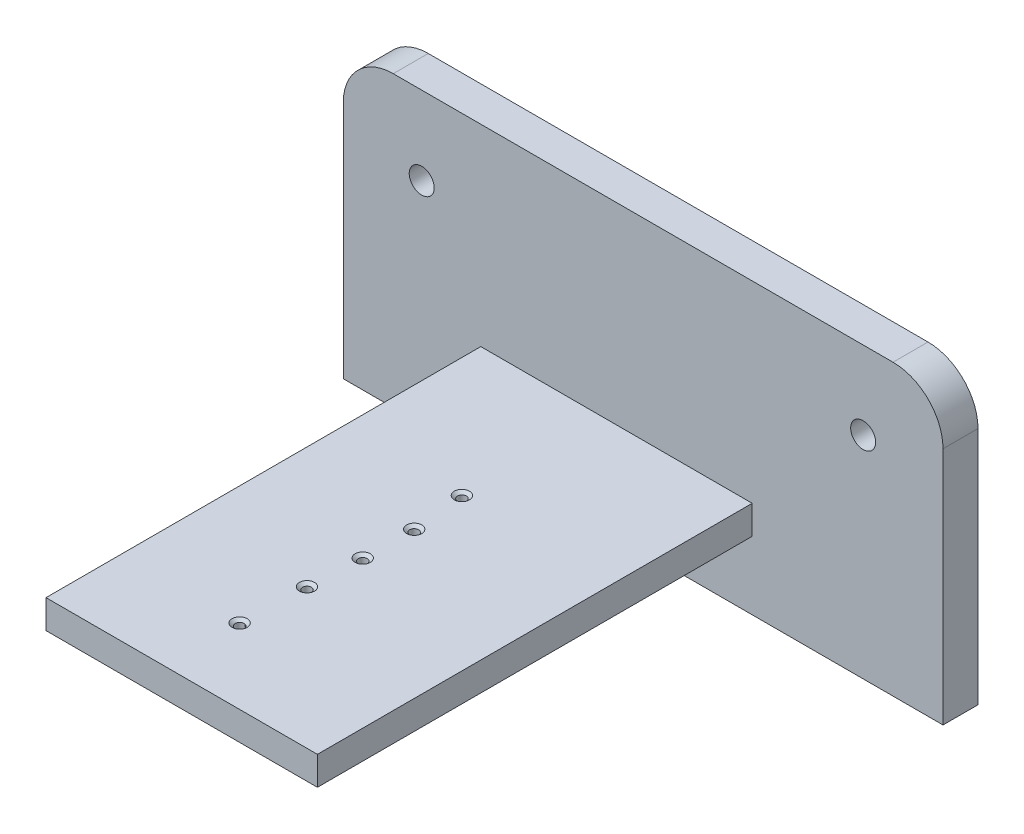
ISO-10303-21;
HEADER;
FILE_DESCRIPTION(('STEP AP214'),'2;1');
FILE_NAME('part.step','',(''),(''),'','','');
FILE_SCHEMA(('AUTOMOTIVE_DESIGN { 1 0 10303 214 1 1 1 1 }'));
ENDSEC;
DATA;
#1=APPLICATION_CONTEXT('core data for automotive mechanical design processes');
#2=APPLICATION_PROTOCOL_DEFINITION('international standard','automotive_design',2000,#1);
#3=PRODUCT_CONTEXT('',#1,'mechanical');
#4=PRODUCT('Part','Part','',(#3));
#5=PRODUCT_RELATED_PRODUCT_CATEGORY('part','',(#4));
#6=PRODUCT_DEFINITION_FORMATION('','',#4);
#7=PRODUCT_DEFINITION_CONTEXT('part definition',#1,'design');
#8=PRODUCT_DEFINITION('design','',#6,#7);
#9=PRODUCT_DEFINITION_SHAPE('','',#8);
#10=(LENGTH_UNIT() NAMED_UNIT(*) SI_UNIT(.MILLI.,.METRE.));
#11=(NAMED_UNIT(*) PLANE_ANGLE_UNIT() SI_UNIT($,.RADIAN.));
#12=(NAMED_UNIT(*) SI_UNIT($,.STERADIAN.) SOLID_ANGLE_UNIT());
#13=UNCERTAINTY_MEASURE_WITH_UNIT(LENGTH_MEASURE(1.E-05),#10,'distance_accuracy_value','');
#14=(GEOMETRIC_REPRESENTATION_CONTEXT(3) GLOBAL_UNCERTAINTY_ASSIGNED_CONTEXT((#13)) GLOBAL_UNIT_ASSIGNED_CONTEXT((#10,
#11,#12)) REPRESENTATION_CONTEXT('',''));
#15=CARTESIAN_POINT('',(0.,0.,0.));
#16=DIRECTION('',(0.,0.,1.));
#17=DIRECTION('',(1.,0.,0.));
#18=AXIS2_PLACEMENT_3D('',#15,#16,#17);
#19=CARTESIAN_POINT('',(0.,0.,7.));
#20=DIRECTION('',(0.,0.,-1.));
#21=DIRECTION('',(-1.,0.,0.));
#22=AXIS2_PLACEMENT_3D('',#19,#20,#21);
#23=PLANE('',#22);
#24=CARTESIAN_POINT('',(43.9129569594668,13.4683747706374,7.));
#25=DIRECTION('',(0.,0.,1.));
#26=DIRECTION('',(1.,0.,0.));
#27=AXIS2_PLACEMENT_3D('',#24,#25,#26);
#28=CIRCLE('',#27,2.5);
#29=CARTESIAN_POINT('',(46.4129569594668,13.4683747706374,7.));
#30=VERTEX_POINT('',#29);
#31=EDGE_CURVE('E146',#30,#30,#28,.T.);
#32=ORIENTED_EDGE('',*,*,#31,.F.);
#33=EDGE_LOOP('',(#32));
#34=FACE_BOUND('',#33,.T.);
#35=CARTESIAN_POINT('',(-44.4128113879004,13.3985765124555,7.));
#36=DIRECTION('',(0.,0.,1.));
#37=DIRECTION('',(1.,0.,0.));
#38=AXIS2_PLACEMENT_3D('',#35,#36,#37);
#39=CIRCLE('',#38,2.5);
#40=CARTESIAN_POINT('',(-41.9128113879004,13.3985765124555,7.));
#41=VERTEX_POINT('',#40);
#42=EDGE_CURVE('E155',#41,#41,#39,.T.);
#43=ORIENTED_EDGE('',*,*,#42,.F.);
#44=EDGE_LOOP('',(#43));
#45=FACE_BOUND('',#44,.T.);
#46=DIRECTION('',(0.,1.,0.));
#47=VECTOR('',#46,1.);
#48=CARTESIAN_POINT('',(59.8932384341637,-28.7722419928826,7.));
#49=LINE('',#48,#47);
#50=CARTESIAN_POINT('',(59.8932384341637,-28.7722419928826,7.));
#51=VERTEX_POINT('',#50);
#52=CARTESIAN_POINT('',(59.8932384341637,19.0925266903915,7.));
#53=VERTEX_POINT('',#52);
#54=EDGE_CURVE('E161',#51,#53,#49,.T.);
#55=ORIENTED_EDGE('',*,*,#54,.T.);
#56=CARTESIAN_POINT('',(49.8932384341637,19.0925266903915,7.));
#57=DIRECTION('',(0.,0.,-1.));
#58=DIRECTION('',(-1.,0.,0.));
#59=AXIS2_PLACEMENT_3D('',#56,#57,#58);
#60=CIRCLE('',#59,10.);
#61=CARTESIAN_POINT('',(49.8932384341637,29.0925266903915,7.));
#62=VERTEX_POINT('',#61);
#63=EDGE_CURVE('E45',#53,#62,#60,.F.);
#64=ORIENTED_EDGE('',*,*,#63,.T.);
#65=DIRECTION('',(-1.,0.,0.));
#66=VECTOR('',#65,1.);
#67=CARTESIAN_POINT('',(-60.1067615658363,29.0925266903915,7.));
#68=LINE('',#67,#66);
#69=CARTESIAN_POINT('',(-50.1067615658363,29.0925266903915,7.));
#70=VERTEX_POINT('',#69);
#71=EDGE_CURVE('E163',#62,#70,#68,.T.);
#72=ORIENTED_EDGE('',*,*,#71,.T.);
#73=CARTESIAN_POINT('',(-50.1067615658363,19.0925266903915,7.));
#74=DIRECTION('',(0.,0.,-1.));
#75=DIRECTION('',(-1.,0.,0.));
#76=AXIS2_PLACEMENT_3D('',#73,#74,#75);
#77=CIRCLE('',#76,10.);
#78=CARTESIAN_POINT('',(-60.1067615658363,19.0925266903915,7.));
#79=VERTEX_POINT('',#78);
#80=EDGE_CURVE('E53',#70,#79,#77,.F.);
#81=ORIENTED_EDGE('',*,*,#80,.T.);
#82=DIRECTION('',(0.,-1.,0.));
#83=VECTOR('',#82,1.);
#84=CARTESIAN_POINT('',(-60.1067615658363,-28.7722419928826,7.));
#85=LINE('',#84,#83);
#86=CARTESIAN_POINT('',(-60.1067615658363,-28.7722419928826,7.));
#87=VERTEX_POINT('',#86);
#88=EDGE_CURVE('E166',#79,#87,#85,.T.);
#89=ORIENTED_EDGE('',*,*,#88,.T.);
#90=DIRECTION('',(1.,0.,0.));
#91=VECTOR('',#90,1.);
#92=CARTESIAN_POINT('',(-60.1067615658363,-28.7722419928826,7.));
#93=LINE('',#92,#91);
#94=EDGE_CURVE('E168',#87,#51,#93,.T.);
#95=ORIENTED_EDGE('',*,*,#94,.T.);
#96=EDGE_LOOP('',(#55,#64,#72,#81,#89,#95));
#97=FACE_BOUND('',#96,.T.);
#98=DIRECTION('',(0.,1.,0.));
#99=VECTOR('',#98,1.);
#100=CARTESIAN_POINT('',(21.716112984393,-15.1625153646933,7.));
#101=LINE('',#100,#99);
#102=CARTESIAN_POINT('',(21.716112984393,-15.1625153646933,7.));
#103=VERTEX_POINT('',#102);
#104=CARTESIAN_POINT('',(21.716112984393,-9.44262442277477,7.));
#105=VERTEX_POINT('',#104);
#106=EDGE_CURVE('E142',#103,#105,#101,.T.);
#107=ORIENTED_EDGE('',*,*,#106,.F.);
#108=DIRECTION('',(1.,0.,0.));
#109=VECTOR('',#108,1.);
#110=CARTESIAN_POINT('',(-32.5899388944322,-15.1625153646933,7.));
#111=LINE('',#110,#109);
#112=CARTESIAN_POINT('',(-32.5899388944322,-15.1625153646933,7.));
#113=VERTEX_POINT('',#112);
#114=EDGE_CURVE('E139',#113,#103,#111,.T.);
#115=ORIENTED_EDGE('',*,*,#114,.F.);
#116=DIRECTION('',(0.,-1.,0.));
#117=VECTOR('',#116,1.);
#118=CARTESIAN_POINT('',(-32.5899388944322,-15.1625153646933,7.));
#119=LINE('',#118,#117);
#120=CARTESIAN_POINT('',(-32.5899388944322,-9.44262442277477,7.));
#121=VERTEX_POINT('',#120);
#122=EDGE_CURVE('E241',#121,#113,#119,.T.);
#123=ORIENTED_EDGE('',*,*,#122,.F.);
#124=DIRECTION('',(-1.,0.,0.));
#125=VECTOR('',#124,1.);
#126=CARTESIAN_POINT('',(-32.5899388944322,-9.44262442277477,7.));
#127=LINE('',#126,#125);
#128=EDGE_CURVE('E239',#105,#121,#127,.T.);
#129=ORIENTED_EDGE('',*,*,#128,.F.);
#130=EDGE_LOOP('',(#107,#115,#123,#129));
#131=FACE_BOUND('',#130,.T.);
#132=ADVANCED_FACE('F36',(#34,#45,#97,#131),#23,.F.);
#133=CARTESIAN_POINT('',(0.,0.,0.));
#134=DIRECTION('',(0.,0.,-1.));
#135=DIRECTION('',(-1.,0.,0.));
#136=AXIS2_PLACEMENT_3D('',#133,#134,#135);
#137=PLANE('',#136);
#138=CARTESIAN_POINT('',(-44.4128113879004,13.3985765124555,0.));
#139=DIRECTION('',(0.,0.,1.));
#140=DIRECTION('',(1.,0.,0.));
#141=AXIS2_PLACEMENT_3D('',#138,#139,#140);
#142=CIRCLE('',#141,2.5);
#143=CARTESIAN_POINT('',(-41.9128113879004,13.3985765124555,0.));
#144=VERTEX_POINT('',#143);
#145=EDGE_CURVE('E153',#144,#144,#142,.T.);
#146=ORIENTED_EDGE('',*,*,#145,.T.);
#147=EDGE_LOOP('',(#146));
#148=FACE_BOUND('',#147,.T.);
#149=DIRECTION('',(-1.,0.,0.));
#150=VECTOR('',#149,1.);
#151=CARTESIAN_POINT('',(-60.1067615658363,29.0925266903915,0.));
#152=LINE('',#151,#150);
#153=CARTESIAN_POINT('',(49.8932384341637,29.0925266903915,0.));
#154=VERTEX_POINT('',#153);
#155=CARTESIAN_POINT('',(-50.1067615658363,29.0925266903915,0.));
#156=VERTEX_POINT('',#155);
#157=EDGE_CURVE('E172',#154,#156,#152,.T.);
#158=ORIENTED_EDGE('',*,*,#157,.F.);
#159=CARTESIAN_POINT('',(49.8932384341637,19.0925266903915,0.));
#160=DIRECTION('',(0.,0.,-1.));
#161=DIRECTION('',(-1.,0.,0.));
#162=AXIS2_PLACEMENT_3D('',#159,#160,#161);
#163=CIRCLE('',#162,10.);
#164=CARTESIAN_POINT('',(59.8932384341637,19.0925266903915,0.));
#165=VERTEX_POINT('',#164);
#166=EDGE_CURVE('E190',#154,#165,#163,.T.);
#167=ORIENTED_EDGE('',*,*,#166,.T.);
#168=DIRECTION('',(0.,1.,0.));
#169=VECTOR('',#168,1.);
#170=CARTESIAN_POINT('',(59.8932384341637,-28.7722419928826,0.));
#171=LINE('',#170,#169);
#172=CARTESIAN_POINT('',(59.8932384341637,-28.7722419928826,0.));
#173=VERTEX_POINT('',#172);
#174=EDGE_CURVE('E158',#173,#165,#171,.T.);
#175=ORIENTED_EDGE('',*,*,#174,.F.);
#176=DIRECTION('',(1.,0.,0.));
#177=VECTOR('',#176,1.);
#178=CARTESIAN_POINT('',(-60.1067615658363,-28.7722419928826,0.));
#179=LINE('',#178,#177);
#180=CARTESIAN_POINT('',(-60.1067615658363,-28.7722419928826,0.));
#181=VERTEX_POINT('',#180);
#182=EDGE_CURVE('E164',#181,#173,#179,.T.);
#183=ORIENTED_EDGE('',*,*,#182,.F.);
#184=DIRECTION('',(0.,-1.,0.));
#185=VECTOR('',#184,1.);
#186=CARTESIAN_POINT('',(-60.1067615658363,-28.7722419928826,0.));
#187=LINE('',#186,#185);
#188=CARTESIAN_POINT('',(-60.1067615658363,19.0925266903915,0.));
#189=VERTEX_POINT('',#188);
#190=EDGE_CURVE('E175',#189,#181,#187,.T.);
#191=ORIENTED_EDGE('',*,*,#190,.F.);
#192=CARTESIAN_POINT('',(-50.1067615658363,19.0925266903915,0.));
#193=DIRECTION('',(0.,0.,-1.));
#194=DIRECTION('',(-1.,0.,0.));
#195=AXIS2_PLACEMENT_3D('',#192,#193,#194);
#196=CIRCLE('',#195,10.);
#197=EDGE_CURVE('E188',#189,#156,#196,.T.);
#198=ORIENTED_EDGE('',*,*,#197,.T.);
#199=EDGE_LOOP('',(#158,#167,#175,#183,#191,#198));
#200=FACE_BOUND('',#199,.T.);
#201=CARTESIAN_POINT('',(43.9129569594668,13.4683747706374,0.));
#202=DIRECTION('',(0.,0.,1.));
#203=DIRECTION('',(1.,0.,0.));
#204=AXIS2_PLACEMENT_3D('',#201,#202,#203);
#205=CIRCLE('',#204,2.5);
#206=CARTESIAN_POINT('',(46.4129569594668,13.4683747706374,0.));
#207=VERTEX_POINT('',#206);
#208=EDGE_CURVE('E143',#207,#207,#205,.T.);
#209=ORIENTED_EDGE('',*,*,#208,.T.);
#210=EDGE_LOOP('',(#209));
#211=FACE_BOUND('',#210,.T.);
#212=ADVANCED_FACE('F254',(#148,#200,#211),#137,.T.);
#213=CARTESIAN_POINT('',(59.8932384341637,-28.7722419928826,7.));
#214=DIRECTION('',(-1.,0.,0.));
#215=DIRECTION('',(0.,0.,1.));
#216=AXIS2_PLACEMENT_3D('',#213,#214,#215);
#217=PLANE('',#216);
#218=ORIENTED_EDGE('',*,*,#174,.T.);
#219=DIRECTION('',(0.,0.,-1.));
#220=VECTOR('',#219,1.);
#221=CARTESIAN_POINT('',(59.8932384341637,19.0925266903915,7.));
#222=LINE('',#221,#220);
#223=EDGE_CURVE('E61',#165,#53,#222,.F.);
#224=ORIENTED_EDGE('',*,*,#223,.T.);
#225=ORIENTED_EDGE('',*,*,#54,.F.);
#226=DIRECTION('',(0.,0.,-1.));
#227=VECTOR('',#226,1.);
#228=CARTESIAN_POINT('',(59.8932384341637,-28.7722419928826,7.));
#229=LINE('',#228,#227);
#230=EDGE_CURVE('E170',#51,#173,#229,.T.);
#231=ORIENTED_EDGE('',*,*,#230,.T.);
#232=EDGE_LOOP('',(#218,#224,#225,#231));
#233=FACE_BOUND('',#232,.T.);
#234=ADVANCED_FACE('F260',(#233),#217,.F.);
#235=CARTESIAN_POINT('',(-60.1067615658363,29.0925266903915,7.));
#236=DIRECTION('',(0.,-1.,0.));
#237=DIRECTION('',(0.,0.,-1.));
#238=AXIS2_PLACEMENT_3D('',#235,#236,#237);
#239=PLANE('',#238);
#240=ORIENTED_EDGE('',*,*,#71,.F.);
#241=DIRECTION('',(0.,0.,-1.));
#242=VECTOR('',#241,1.);
#243=CARTESIAN_POINT('',(49.8932384341637,29.0925266903915,7.));
#244=LINE('',#243,#242);
#245=EDGE_CURVE('E185',#62,#154,#244,.T.);
#246=ORIENTED_EDGE('',*,*,#245,.T.);
#247=ORIENTED_EDGE('',*,*,#157,.T.);
#248=DIRECTION('',(0.,0.,-1.));
#249=VECTOR('',#248,1.);
#250=CARTESIAN_POINT('',(-50.1067615658363,29.0925266903915,7.));
#251=LINE('',#250,#249);
#252=EDGE_CURVE('E183',#156,#70,#251,.F.);
#253=ORIENTED_EDGE('',*,*,#252,.T.);
#254=EDGE_LOOP('',(#240,#246,#247,#253));
#255=FACE_BOUND('',#254,.T.);
#256=ADVANCED_FACE('F276',(#255),#239,.F.);
#257=CARTESIAN_POINT('',(-60.1067615658363,-28.7722419928826,7.));
#258=DIRECTION('',(1.,0.,0.));
#259=DIRECTION('',(0.,0.,-1.));
#260=AXIS2_PLACEMENT_3D('',#257,#258,#259);
#261=PLANE('',#260);
#262=ORIENTED_EDGE('',*,*,#88,.F.);
#263=DIRECTION('',(0.,0.,-1.));
#264=VECTOR('',#263,1.);
#265=CARTESIAN_POINT('',(-60.1067615658363,19.0925266903915,7.));
#266=LINE('',#265,#264);
#267=EDGE_CURVE('E11',#79,#189,#266,.T.);
#268=ORIENTED_EDGE('',*,*,#267,.T.);
#269=ORIENTED_EDGE('',*,*,#190,.T.);
#270=DIRECTION('',(0.,0.,-1.));
#271=VECTOR('',#270,1.);
#272=CARTESIAN_POINT('',(-60.1067615658363,-28.7722419928826,7.));
#273=LINE('',#272,#271);
#274=EDGE_CURVE('E180',#87,#181,#273,.T.);
#275=ORIENTED_EDGE('',*,*,#274,.F.);
#276=EDGE_LOOP('',(#262,#268,#269,#275));
#277=FACE_BOUND('',#276,.T.);
#278=ADVANCED_FACE('F272',(#277),#261,.F.);
#279=CARTESIAN_POINT('',(-60.1067615658363,-28.7722419928826,7.));
#280=DIRECTION('',(0.,1.,0.));
#281=DIRECTION('',(0.,0.,1.));
#282=AXIS2_PLACEMENT_3D('',#279,#280,#281);
#283=PLANE('',#282);
#284=ORIENTED_EDGE('',*,*,#182,.T.);
#285=ORIENTED_EDGE('',*,*,#230,.F.);
#286=ORIENTED_EDGE('',*,*,#94,.F.);
#287=ORIENTED_EDGE('',*,*,#274,.T.);
#288=EDGE_LOOP('',(#284,#285,#286,#287));
#289=FACE_BOUND('',#288,.T.);
#290=ADVANCED_FACE('F269',(#289),#283,.F.);
#291=CARTESIAN_POINT('',(-44.4128113879004,13.3985765124555,7.));
#292=DIRECTION('',(0.,0.,-1.));
#293=DIRECTION('',(-1.,0.,0.));
#294=AXIS2_PLACEMENT_3D('',#291,#292,#293);
#295=CYLINDRICAL_SURFACE('',#294,2.5);
#296=ORIENTED_EDGE('',*,*,#42,.T.);
#297=EDGE_LOOP('',(#296));
#298=FACE_BOUND('',#297,.T.);
#299=ORIENTED_EDGE('',*,*,#145,.F.);
#300=EDGE_LOOP('',(#299));
#301=FACE_BOUND('',#300,.T.);
#302=ADVANCED_FACE('F266',(#298,#301),#295,.F.);
#303=CARTESIAN_POINT('',(43.9129569594668,13.4683747706374,7.));
#304=DIRECTION('',(0.,0.,-1.));
#305=DIRECTION('',(-1.,0.,0.));
#306=AXIS2_PLACEMENT_3D('',#303,#304,#305);
#307=CYLINDRICAL_SURFACE('',#306,2.5);
#308=ORIENTED_EDGE('',*,*,#31,.T.);
#309=EDGE_LOOP('',(#308));
#310=FACE_BOUND('',#309,.T.);
#311=ORIENTED_EDGE('',*,*,#208,.F.);
#312=EDGE_LOOP('',(#311));
#313=FACE_BOUND('',#312,.T.);
#314=ADVANCED_FACE('F308',(#310,#313),#307,.F.);
#315=CARTESIAN_POINT('',(21.716112984393,-15.1625153646933,94.));
#316=DIRECTION('',(-1.,0.,0.));
#317=DIRECTION('',(0.,0.,1.));
#318=AXIS2_PLACEMENT_3D('',#315,#316,#317);
#319=PLANE('',#318);
#320=ORIENTED_EDGE('',*,*,#106,.T.);
#321=DIRECTION('',(0.,0.,-1.));
#322=VECTOR('',#321,1.);
#323=CARTESIAN_POINT('',(21.716112984393,-9.44262442277477,94.));
#324=LINE('',#323,#322);
#325=CARTESIAN_POINT('',(21.716112984393,-9.44262442277477,94.));
#326=VERTEX_POINT('',#325);
#327=EDGE_CURVE('E123',#326,#105,#324,.T.);
#328=ORIENTED_EDGE('',*,*,#327,.F.);
#329=DIRECTION('',(0.,1.,0.));
#330=VECTOR('',#329,1.);
#331=CARTESIAN_POINT('',(21.716112984393,-15.1625153646933,94.));
#332=LINE('',#331,#330);
#333=CARTESIAN_POINT('',(21.716112984393,-15.1625153646933,94.));
#334=VERTEX_POINT('',#333);
#335=EDGE_CURVE('E130',#334,#326,#332,.T.);
#336=ORIENTED_EDGE('',*,*,#335,.F.);
#337=DIRECTION('',(0.,0.,-1.));
#338=VECTOR('',#337,1.);
#339=CARTESIAN_POINT('',(21.716112984393,-15.1625153646933,94.));
#340=LINE('',#339,#338);
#341=EDGE_CURVE('E237',#334,#103,#340,.T.);
#342=ORIENTED_EDGE('',*,*,#341,.T.);
#343=EDGE_LOOP('',(#320,#328,#336,#342));
#344=FACE_BOUND('',#343,.T.);
#345=ADVANCED_FACE('F141',(#344),#319,.F.);
#346=CARTESIAN_POINT('',(-32.5899388944322,-9.44262442277477,94.));
#347=DIRECTION('',(0.,-1.,0.));
#348=DIRECTION('',(0.,0.,-1.));
#349=AXIS2_PLACEMENT_3D('',#346,#347,#348);
#350=PLANE('',#349);
#351=CARTESIAN_POINT('',(-8.67539338059942,-9.44262442277477,34.6995806312975));
#352=DIRECTION('',(0.,1.,0.));
#353=DIRECTION('',(0.,0.,1.));
#354=AXIS2_PLACEMENT_3D('',#351,#352,#353);
#355=CIRCLE('',#354,1.5113);
#356=CARTESIAN_POINT('',(-8.67539338059942,-9.44262442277477,36.2108806312975));
#357=VERTEX_POINT('',#356);
#358=EDGE_CURVE('E371',#357,#357,#355,.T.);
#359=ORIENTED_EDGE('',*,*,#358,.F.);
#360=EDGE_LOOP('',(#359));
#361=FACE_BOUND('',#360,.T.);
#362=CARTESIAN_POINT('',(-7.59934602604062,-9.44262442277477,45.3148854551273));
#363=DIRECTION('',(0.,1.,0.));
#364=DIRECTION('',(0.,0.,1.));
#365=AXIS2_PLACEMENT_3D('',#362,#363,#364);
#366=CIRCLE('',#365,1.5113);
#367=CARTESIAN_POINT('',(-7.59934602604062,-9.44262442277477,46.8261854551273));
#368=VERTEX_POINT('',#367);
#369=EDGE_CURVE('E217',#368,#368,#366,.T.);
#370=ORIENTED_EDGE('',*,*,#369,.F.);
#371=EDGE_LOOP('',(#370));
#372=FACE_BOUND('',#371,.T.);
#373=CARTESIAN_POINT('',(-7.757212547574,-9.44262442277477,55.462997779216));
#374=DIRECTION('',(0.,1.,0.));
#375=DIRECTION('',(0.,0.,1.));
#376=AXIS2_PLACEMENT_3D('',#373,#374,#375);
#377=CIRCLE('',#376,1.5113);
#378=CARTESIAN_POINT('',(-7.757212547574,-9.44262442277477,56.974297779216));
#379=VERTEX_POINT('',#378);
#380=EDGE_CURVE('E210',#379,#379,#377,.T.);
#381=ORIENTED_EDGE('',*,*,#380,.F.);
#382=EDGE_LOOP('',(#381));
#383=FACE_BOUND('',#382,.T.);
#384=CARTESIAN_POINT('',(-8.36402216077659,-9.44262442277477,66.0077701162436));
#385=DIRECTION('',(0.,1.,0.));
#386=DIRECTION('',(0.,0.,1.));
#387=AXIS2_PLACEMENT_3D('',#384,#385,#386);
#388=CIRCLE('',#387,1.5113);
#389=CARTESIAN_POINT('',(-8.36402216077659,-9.44262442277477,67.5190701162436));
#390=VERTEX_POINT('',#389);
#391=EDGE_CURVE('E206',#390,#390,#388,.T.);
#392=ORIENTED_EDGE('',*,*,#391,.F.);
#393=EDGE_LOOP('',(#392));
#394=FACE_BOUND('',#393,.T.);
#395=CARTESIAN_POINT('',(-8.81682169614351,-9.44262442277477,79.0274152278698));
#396=DIRECTION('',(0.,1.,0.));
#397=DIRECTION('',(0.,0.,1.));
#398=AXIS2_PLACEMENT_3D('',#395,#396,#397);
#399=CIRCLE('',#398,1.5113);
#400=CARTESIAN_POINT('',(-8.81682169614351,-9.44262442277477,80.5387152278698));
#401=VERTEX_POINT('',#400);
#402=EDGE_CURVE('E202',#401,#401,#399,.T.);
#403=ORIENTED_EDGE('',*,*,#402,.F.);
#404=EDGE_LOOP('',(#403));
#405=FACE_BOUND('',#404,.T.);
#406=ORIENTED_EDGE('',*,*,#128,.T.);
#407=DIRECTION('',(0.,0.,-1.));
#408=VECTOR('',#407,1.);
#409=CARTESIAN_POINT('',(-32.5899388944322,-9.44262442277477,94.));
#410=LINE('',#409,#408);
#411=CARTESIAN_POINT('',(-32.5899388944322,-9.44262442277477,94.));
#412=VERTEX_POINT('',#411);
#413=EDGE_CURVE('E126',#412,#121,#410,.T.);
#414=ORIENTED_EDGE('',*,*,#413,.F.);
#415=DIRECTION('',(-1.,0.,0.));
#416=VECTOR('',#415,1.);
#417=CARTESIAN_POINT('',(-32.5899388944322,-9.44262442277477,94.));
#418=LINE('',#417,#416);
#419=EDGE_CURVE('E118',#326,#412,#418,.T.);
#420=ORIENTED_EDGE('',*,*,#419,.F.);
#421=ORIENTED_EDGE('',*,*,#327,.T.);
#422=EDGE_LOOP('',(#406,#414,#420,#421));
#423=FACE_BOUND('',#422,.T.);
#424=ADVANCED_FACE('F121',(#361,#372,#383,#394,#405,#423),#350,.F.);
#425=CARTESIAN_POINT('',(-32.5899388944322,-15.1625153646933,94.));
#426=DIRECTION('',(1.,0.,0.));
#427=DIRECTION('',(0.,0.,-1.));
#428=AXIS2_PLACEMENT_3D('',#425,#426,#427);
#429=PLANE('',#428);
#430=ORIENTED_EDGE('',*,*,#122,.T.);
#431=DIRECTION('',(0.,0.,-1.));
#432=VECTOR('',#431,1.);
#433=CARTESIAN_POINT('',(-32.5899388944322,-15.1625153646933,94.));
#434=LINE('',#433,#432);
#435=CARTESIAN_POINT('',(-32.5899388944322,-15.1625153646933,94.));
#436=VERTEX_POINT('',#435);
#437=EDGE_CURVE('E148',#436,#113,#434,.T.);
#438=ORIENTED_EDGE('',*,*,#437,.F.);
#439=DIRECTION('',(0.,-1.,0.));
#440=VECTOR('',#439,1.);
#441=CARTESIAN_POINT('',(-32.5899388944322,-15.1625153646933,94.));
#442=LINE('',#441,#440);
#443=EDGE_CURVE('E129',#412,#436,#442,.T.);
#444=ORIENTED_EDGE('',*,*,#443,.F.);
#445=ORIENTED_EDGE('',*,*,#413,.T.);
#446=EDGE_LOOP('',(#430,#438,#444,#445));
#447=FACE_BOUND('',#446,.T.);
#448=ADVANCED_FACE('F251',(#447),#429,.F.);
#449=CARTESIAN_POINT('',(-32.5899388944322,-15.1625153646933,94.));
#450=DIRECTION('',(0.,1.,0.));
#451=DIRECTION('',(0.,0.,1.));
#452=AXIS2_PLACEMENT_3D('',#449,#450,#451);
#453=PLANE('',#452);
#454=CARTESIAN_POINT('',(-8.67539338059942,-15.1625153646933,34.6995806312975));
#455=DIRECTION('',(0.,1.,0.));
#456=DIRECTION('',(0.,0.,1.));
#457=AXIS2_PLACEMENT_3D('',#454,#455,#456);
#458=CIRCLE('',#457,0.889);
#459=CARTESIAN_POINT('',(-8.67539338059942,-15.1625153646933,35.5885806312975));
#460=VERTEX_POINT('',#459);
#461=EDGE_CURVE('E40',#460,#460,#458,.T.);
#462=ORIENTED_EDGE('',*,*,#461,.T.);
#463=EDGE_LOOP('',(#462));
#464=FACE_BOUND('',#463,.T.);
#465=CARTESIAN_POINT('',(-7.59934602604062,-15.1625153646933,45.3148854551273));
#466=DIRECTION('',(0.,1.,0.));
#467=DIRECTION('',(0.,0.,1.));
#468=AXIS2_PLACEMENT_3D('',#465,#466,#467);
#469=CIRCLE('',#468,0.889);
#470=CARTESIAN_POINT('',(-7.59934602604062,-15.1625153646933,46.2038854551273));
#471=VERTEX_POINT('',#470);
#472=EDGE_CURVE('E208',#471,#471,#469,.T.);
#473=ORIENTED_EDGE('',*,*,#472,.T.);
#474=EDGE_LOOP('',(#473));
#475=FACE_BOUND('',#474,.T.);
#476=CARTESIAN_POINT('',(-7.757212547574,-15.1625153646933,55.462997779216));
#477=DIRECTION('',(0.,1.,0.));
#478=DIRECTION('',(0.,0.,1.));
#479=AXIS2_PLACEMENT_3D('',#476,#477,#478);
#480=CIRCLE('',#479,0.889);
#481=CARTESIAN_POINT('',(-7.757212547574,-15.1625153646933,56.351997779216));
#482=VERTEX_POINT('',#481);
#483=EDGE_CURVE('E204',#482,#482,#480,.T.);
#484=ORIENTED_EDGE('',*,*,#483,.T.);
#485=EDGE_LOOP('',(#484));
#486=FACE_BOUND('',#485,.T.);
#487=CARTESIAN_POINT('',(-8.36402216077659,-15.1625153646933,66.0077701162436));
#488=DIRECTION('',(0.,1.,0.));
#489=DIRECTION('',(0.,0.,1.));
#490=AXIS2_PLACEMENT_3D('',#487,#488,#489);
#491=CIRCLE('',#490,0.889);
#492=CARTESIAN_POINT('',(-8.36402216077659,-15.1625153646933,66.8967701162436));
#493=VERTEX_POINT('',#492);
#494=EDGE_CURVE('E199',#493,#493,#491,.T.);
#495=ORIENTED_EDGE('',*,*,#494,.T.);
#496=EDGE_LOOP('',(#495));
#497=FACE_BOUND('',#496,.T.);
#498=CARTESIAN_POINT('',(-8.81682169614351,-15.1625153646933,79.0274152278698));
#499=DIRECTION('',(0.,1.,0.));
#500=DIRECTION('',(0.,0.,1.));
#501=AXIS2_PLACEMENT_3D('',#498,#499,#500);
#502=CIRCLE('',#501,0.889000000000001);
#503=CARTESIAN_POINT('',(-8.81682169614351,-15.1625153646933,79.9164152278698));
#504=VERTEX_POINT('',#503);
#505=EDGE_CURVE('E195',#504,#504,#502,.T.);
#506=ORIENTED_EDGE('',*,*,#505,.T.);
#507=EDGE_LOOP('',(#506));
#508=FACE_BOUND('',#507,.T.);
#509=ORIENTED_EDGE('',*,*,#114,.T.);
#510=ORIENTED_EDGE('',*,*,#341,.F.);
#511=DIRECTION('',(1.,0.,0.));
#512=VECTOR('',#511,1.);
#513=CARTESIAN_POINT('',(-32.5899388944322,-15.1625153646933,94.));
#514=LINE('',#513,#512);
#515=EDGE_CURVE('E135',#436,#334,#514,.T.);
#516=ORIENTED_EDGE('',*,*,#515,.F.);
#517=ORIENTED_EDGE('',*,*,#437,.T.);
#518=EDGE_LOOP('',(#509,#510,#516,#517));
#519=FACE_BOUND('',#518,.T.);
#520=ADVANCED_FACE('F249',(#464,#475,#486,#497,#508,#519),#453,.F.);
#521=CARTESIAN_POINT('',(0.,0.,94.));
#522=DIRECTION('',(0.,0.,-1.));
#523=DIRECTION('',(-1.,0.,0.));
#524=AXIS2_PLACEMENT_3D('',#521,#522,#523);
#525=PLANE('',#524);
#526=ORIENTED_EDGE('',*,*,#335,.T.);
#527=ORIENTED_EDGE('',*,*,#419,.T.);
#528=ORIENTED_EDGE('',*,*,#443,.T.);
#529=ORIENTED_EDGE('',*,*,#515,.T.);
#530=EDGE_LOOP('',(#526,#527,#528,#529));
#531=FACE_BOUND('',#530,.T.);
#532=ADVANCED_FACE('F133',(#531),#525,.F.);
#533=CARTESIAN_POINT('',(49.8932384341637,19.0925266903915,7.));
#534=DIRECTION('',(0.,0.,-1.));
#535=DIRECTION('',(-1.,0.,0.));
#536=AXIS2_PLACEMENT_3D('',#533,#534,#535);
#537=CYLINDRICAL_SURFACE('',#536,10.);
#538=ORIENTED_EDGE('',*,*,#63,.F.);
#539=ORIENTED_EDGE('',*,*,#223,.F.);
#540=ORIENTED_EDGE('',*,*,#166,.F.);
#541=ORIENTED_EDGE('',*,*,#245,.F.);
#542=EDGE_LOOP('',(#538,#539,#540,#541));
#543=FACE_BOUND('',#542,.T.);
#544=ADVANCED_FACE('F282',(#543),#537,.T.);
#545=CARTESIAN_POINT('',(-50.1067615658363,19.0925266903915,7.));
#546=DIRECTION('',(0.,0.,-1.));
#547=DIRECTION('',(-1.,0.,0.));
#548=AXIS2_PLACEMENT_3D('',#545,#546,#547);
#549=CYLINDRICAL_SURFACE('',#548,10.);
#550=ORIENTED_EDGE('',*,*,#80,.F.);
#551=ORIENTED_EDGE('',*,*,#252,.F.);
#552=ORIENTED_EDGE('',*,*,#197,.F.);
#553=ORIENTED_EDGE('',*,*,#267,.F.);
#554=EDGE_LOOP('',(#550,#551,#552,#553));
#555=FACE_BOUND('',#554,.T.);
#556=ADVANCED_FACE('F38',(#555),#549,.T.);
#557=CARTESIAN_POINT('',(-8.81682169614351,-9.44262442277477,79.0274152278698));
#558=DIRECTION('',(0.,1.,0.));
#559=DIRECTION('',(0.,0.,1.));
#560=AXIS2_PLACEMENT_3D('',#557,#558,#559);
#561=CYLINDRICAL_SURFACE('',#560,0.889000000000001);
#562=CARTESIAN_POINT('',(-8.81682169614351,-9.96479612325639,79.0274152278698));
#563=DIRECTION('',(0.,1.,0.));
#564=DIRECTION('',(0.,0.,1.));
#565=AXIS2_PLACEMENT_3D('',#562,#563,#564);
#566=CIRCLE('',#565,0.889000000000001);
#567=CARTESIAN_POINT('',(-8.81682169614351,-9.96479612325639,79.9164152278698));
#568=VERTEX_POINT('',#567);
#569=EDGE_CURVE('E198',#568,#568,#566,.T.);
#570=ORIENTED_EDGE('',*,*,#569,.T.);
#571=EDGE_LOOP('',(#570));
#572=FACE_BOUND('',#571,.T.);
#573=ORIENTED_EDGE('',*,*,#505,.F.);
#574=EDGE_LOOP('',(#573));
#575=FACE_BOUND('',#574,.T.);
#576=ADVANCED_FACE('F289',(#572,#575),#561,.F.);
#577=CARTESIAN_POINT('',(-8.81682169614351,-9.44262442277477,79.0274152278698));
#578=DIRECTION('',(0.,1.,0.));
#579=DIRECTION('',(0.,0.,1.));
#580=AXIS2_PLACEMENT_3D('',#577,#578,#579);
#581=CONICAL_SURFACE('',#580,1.5113,0.872664625997163);
#582=ORIENTED_EDGE('',*,*,#569,.F.);
#583=EDGE_LOOP('',(#582));
#584=FACE_BOUND('',#583,.T.);
#585=ORIENTED_EDGE('',*,*,#402,.T.);
#586=EDGE_LOOP('',(#585));
#587=FACE_BOUND('',#586,.T.);
#588=ADVANCED_FACE('F328',(#584,#587),#581,.F.);
#589=CARTESIAN_POINT('',(-8.36402216077659,-9.44262442277477,66.0077701162436));
#590=DIRECTION('',(0.,1.,0.));
#591=DIRECTION('',(0.,0.,1.));
#592=AXIS2_PLACEMENT_3D('',#589,#590,#591);
#593=CYLINDRICAL_SURFACE('',#592,0.889);
#594=CARTESIAN_POINT('',(-8.36402216077659,-9.96479612325639,66.0077701162436));
#595=DIRECTION('',(0.,1.,0.));
#596=DIRECTION('',(0.,0.,1.));
#597=AXIS2_PLACEMENT_3D('',#594,#595,#596);
#598=CIRCLE('',#597,0.889);
#599=CARTESIAN_POINT('',(-8.36402216077659,-9.96479612325639,66.8967701162436));
#600=VERTEX_POINT('',#599);
#601=EDGE_CURVE('E203',#600,#600,#598,.T.);
#602=ORIENTED_EDGE('',*,*,#601,.T.);
#603=EDGE_LOOP('',(#602));
#604=FACE_BOUND('',#603,.T.);
#605=ORIENTED_EDGE('',*,*,#494,.F.);
#606=EDGE_LOOP('',(#605));
#607=FACE_BOUND('',#606,.T.);
#608=ADVANCED_FACE('F332',(#604,#607),#593,.F.);
#609=CARTESIAN_POINT('',(-8.36402216077659,-9.44262442277477,66.0077701162436));
#610=DIRECTION('',(0.,1.,0.));
#611=DIRECTION('',(0.,0.,1.));
#612=AXIS2_PLACEMENT_3D('',#609,#610,#611);
#613=CONICAL_SURFACE('',#612,1.5113,0.872664625997164);
#614=ORIENTED_EDGE('',*,*,#601,.F.);
#615=EDGE_LOOP('',(#614));
#616=FACE_BOUND('',#615,.T.);
#617=ORIENTED_EDGE('',*,*,#391,.T.);
#618=EDGE_LOOP('',(#617));
#619=FACE_BOUND('',#618,.T.);
#620=ADVANCED_FACE('F336',(#616,#619),#613,.F.);
#621=CARTESIAN_POINT('',(-7.757212547574,-9.44262442277477,55.462997779216));
#622=DIRECTION('',(0.,1.,0.));
#623=DIRECTION('',(0.,0.,1.));
#624=AXIS2_PLACEMENT_3D('',#621,#622,#623);
#625=CYLINDRICAL_SURFACE('',#624,0.889);
#626=CARTESIAN_POINT('',(-7.757212547574,-9.96479612325639,55.462997779216));
#627=DIRECTION('',(0.,1.,0.));
#628=DIRECTION('',(0.,0.,1.));
#629=AXIS2_PLACEMENT_3D('',#626,#627,#628);
#630=CIRCLE('',#629,0.889);
#631=CARTESIAN_POINT('',(-7.757212547574,-9.96479612325639,56.351997779216));
#632=VERTEX_POINT('',#631);
#633=EDGE_CURVE('E207',#632,#632,#630,.T.);
#634=ORIENTED_EDGE('',*,*,#633,.T.);
#635=EDGE_LOOP('',(#634));
#636=FACE_BOUND('',#635,.T.);
#637=ORIENTED_EDGE('',*,*,#483,.F.);
#638=EDGE_LOOP('',(#637));
#639=FACE_BOUND('',#638,.T.);
#640=ADVANCED_FACE('F340',(#636,#639),#625,.F.);
#641=CARTESIAN_POINT('',(-7.757212547574,-9.44262442277477,55.462997779216));
#642=DIRECTION('',(0.,1.,0.));
#643=DIRECTION('',(0.,0.,1.));
#644=AXIS2_PLACEMENT_3D('',#641,#642,#643);
#645=CONICAL_SURFACE('',#644,1.5113,0.872664625997164);
#646=ORIENTED_EDGE('',*,*,#633,.F.);
#647=EDGE_LOOP('',(#646));
#648=FACE_BOUND('',#647,.T.);
#649=ORIENTED_EDGE('',*,*,#380,.T.);
#650=EDGE_LOOP('',(#649));
#651=FACE_BOUND('',#650,.T.);
#652=ADVANCED_FACE('F344',(#648,#651),#645,.F.);
#653=CARTESIAN_POINT('',(-7.59934602604062,-9.44262442277477,45.3148854551273));
#654=DIRECTION('',(0.,1.,0.));
#655=DIRECTION('',(0.,0.,1.));
#656=AXIS2_PLACEMENT_3D('',#653,#654,#655);
#657=CYLINDRICAL_SURFACE('',#656,0.889);
#658=CARTESIAN_POINT('',(-7.59934602604062,-9.96479612325639,45.3148854551273));
#659=DIRECTION('',(0.,1.,0.));
#660=DIRECTION('',(0.,0.,1.));
#661=AXIS2_PLACEMENT_3D('',#658,#659,#660);
#662=CIRCLE('',#661,0.889);
#663=CARTESIAN_POINT('',(-7.59934602604062,-9.96479612325639,46.2038854551273));
#664=VERTEX_POINT('',#663);
#665=EDGE_CURVE('E211',#664,#664,#662,.T.);
#666=ORIENTED_EDGE('',*,*,#665,.T.);
#667=EDGE_LOOP('',(#666));
#668=FACE_BOUND('',#667,.T.);
#669=ORIENTED_EDGE('',*,*,#472,.F.);
#670=EDGE_LOOP('',(#669));
#671=FACE_BOUND('',#670,.T.);
#672=ADVANCED_FACE('F348',(#668,#671),#657,.F.);
#673=CARTESIAN_POINT('',(-7.59934602604062,-9.44262442277477,45.3148854551273));
#674=DIRECTION('',(0.,1.,0.));
#675=DIRECTION('',(0.,0.,1.));
#676=AXIS2_PLACEMENT_3D('',#673,#674,#675);
#677=CONICAL_SURFACE('',#676,1.5113,0.872664625997164);
#678=ORIENTED_EDGE('',*,*,#665,.F.);
#679=EDGE_LOOP('',(#678));
#680=FACE_BOUND('',#679,.T.);
#681=ORIENTED_EDGE('',*,*,#369,.T.);
#682=EDGE_LOOP('',(#681));
#683=FACE_BOUND('',#682,.T.);
#684=ADVANCED_FACE('F352',(#680,#683),#677,.F.);
#685=CARTESIAN_POINT('',(-8.67539338059942,-9.44262442277477,34.6995806312975));
#686=DIRECTION('',(0.,1.,0.));
#687=DIRECTION('',(0.,0.,1.));
#688=AXIS2_PLACEMENT_3D('',#685,#686,#687);
#689=CYLINDRICAL_SURFACE('',#688,0.889);
#690=CARTESIAN_POINT('',(-8.67539338059942,-9.96479612325639,34.6995806312975));
#691=DIRECTION('',(0.,1.,0.));
#692=DIRECTION('',(0.,0.,1.));
#693=AXIS2_PLACEMENT_3D('',#690,#691,#692);
#694=CIRCLE('',#693,0.889);
#695=CARTESIAN_POINT('',(-8.67539338059942,-9.96479612325639,35.5885806312975));
#696=VERTEX_POINT('',#695);
#697=EDGE_CURVE('E368',#696,#696,#694,.T.);
#698=ORIENTED_EDGE('',*,*,#697,.T.);
#699=EDGE_LOOP('',(#698));
#700=FACE_BOUND('',#699,.T.);
#701=ORIENTED_EDGE('',*,*,#461,.F.);
#702=EDGE_LOOP('',(#701));
#703=FACE_BOUND('',#702,.T.);
#704=ADVANCED_FACE('F355',(#700,#703),#689,.F.);
#705=CARTESIAN_POINT('',(-8.67539338059942,-9.44262442277477,34.6995806312975));
#706=DIRECTION('',(0.,1.,0.));
#707=DIRECTION('',(0.,0.,1.));
#708=AXIS2_PLACEMENT_3D('',#705,#706,#707);
#709=CONICAL_SURFACE('',#708,1.5113,0.872664625997164);
#710=ORIENTED_EDGE('',*,*,#697,.F.);
#711=EDGE_LOOP('',(#710));
#712=FACE_BOUND('',#711,.T.);
#713=ORIENTED_EDGE('',*,*,#358,.T.);
#714=EDGE_LOOP('',(#713));
#715=FACE_BOUND('',#714,.T.);
#716=ADVANCED_FACE('F359',(#712,#715),#709,.F.);
#717=CLOSED_SHELL('',(#132,#212,#234,#256,#278,#290,#302,#314,#345,#424,#448,#520,#532,#544,
#556,#576,#588,#608,#620,#640,#652,#672,#684,#704,#716));
#718=MANIFOLD_SOLID_BREP('B2',#717);
#719=ADVANCED_BREP_SHAPE_REPRESENTATION('',(#18,#718),#14);
#720=SHAPE_DEFINITION_REPRESENTATION(#9,#719);
ENDSEC;
END-ISO-10303-21;
